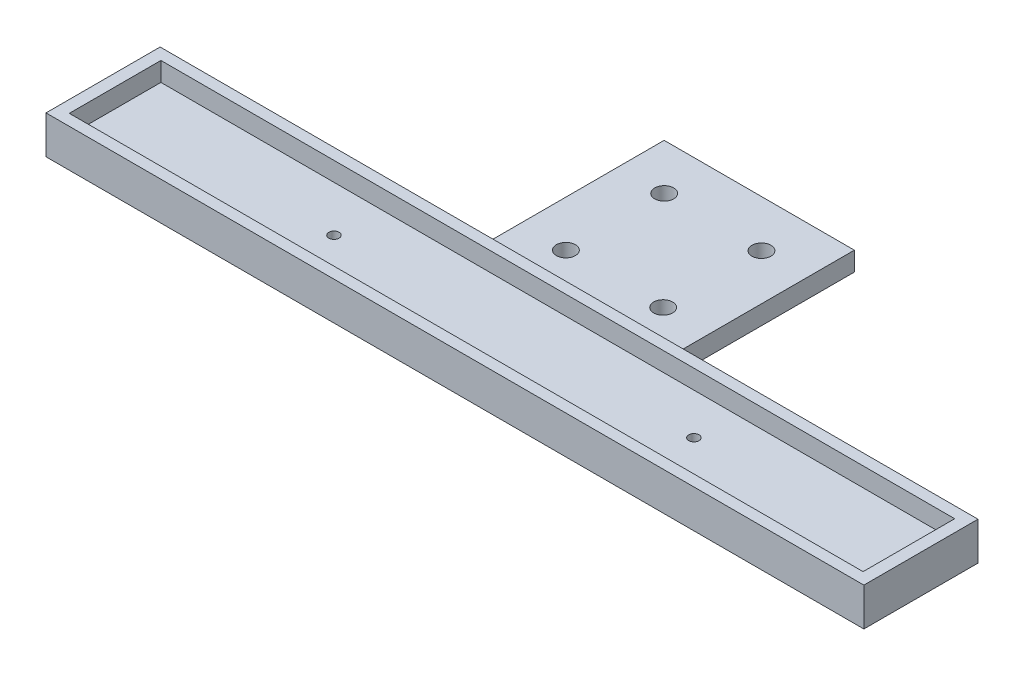
ISO-10303-21;
HEADER;
FILE_DESCRIPTION(('STEP AP214'),'2;1');
FILE_NAME('part.step','',(''),(''),'','','');
FILE_SCHEMA(('AUTOMOTIVE_DESIGN { 1 0 10303 214 1 1 1 1 }'));
ENDSEC;
DATA;
#1=APPLICATION_CONTEXT('core data for automotive mechanical design processes');
#2=APPLICATION_PROTOCOL_DEFINITION('international standard','automotive_design',2000,#1);
#3=PRODUCT_CONTEXT('',#1,'mechanical');
#4=PRODUCT('Part','Part','',(#3));
#5=PRODUCT_RELATED_PRODUCT_CATEGORY('part','',(#4));
#6=PRODUCT_DEFINITION_FORMATION('','',#4);
#7=PRODUCT_DEFINITION_CONTEXT('part definition',#1,'design');
#8=PRODUCT_DEFINITION('design','',#6,#7);
#9=PRODUCT_DEFINITION_SHAPE('','',#8);
#10=(LENGTH_UNIT() NAMED_UNIT(*) SI_UNIT(.MILLI.,.METRE.));
#11=(NAMED_UNIT(*) PLANE_ANGLE_UNIT() SI_UNIT($,.RADIAN.));
#12=(NAMED_UNIT(*) SI_UNIT($,.STERADIAN.) SOLID_ANGLE_UNIT());
#13=UNCERTAINTY_MEASURE_WITH_UNIT(LENGTH_MEASURE(1.E-05),#10,'distance_accuracy_value','');
#14=(GEOMETRIC_REPRESENTATION_CONTEXT(3) GLOBAL_UNCERTAINTY_ASSIGNED_CONTEXT((#13)) GLOBAL_UNIT_ASSIGNED_CONTEXT((#10,
#11,#12)) REPRESENTATION_CONTEXT('',''));
#15=CARTESIAN_POINT('',(0.,0.,0.));
#16=DIRECTION('',(0.,0.,1.));
#17=DIRECTION('',(1.,0.,0.));
#18=AXIS2_PLACEMENT_3D('',#15,#16,#17);
#19=CARTESIAN_POINT('',(64.4999999999998,3.,-9.00000000000003));
#20=DIRECTION('',(0.,0.,1.));
#21=DIRECTION('',(1.,0.,0.));
#22=AXIS2_PLACEMENT_3D('',#19,#20,#21);
#23=PLANE('',#22);
#24=DIRECTION('',(0.,-1.,0.));
#25=VECTOR('',#24,1.);
#26=CARTESIAN_POINT('',(15.,0.,-9.00000000000001));
#27=LINE('',#26,#25);
#28=CARTESIAN_POINT('',(15.,0.,-9.00000000000001));
#29=VERTEX_POINT('',#28);
#30=CARTESIAN_POINT('',(15.,-3.,-9.00000000000001));
#31=VERTEX_POINT('',#30);
#32=EDGE_CURVE('E157',#29,#31,#27,.T.);
#33=ORIENTED_EDGE('',*,*,#32,.F.);
#34=DIRECTION('',(-1.,0.,0.));
#35=VECTOR('',#34,1.);
#36=CARTESIAN_POINT('',(-15.,0.,-9.00000000000001));
#37=LINE('',#36,#35);
#38=CARTESIAN_POINT('',(-15.,0.,-9.00000000000001));
#39=VERTEX_POINT('',#38);
#40=EDGE_CURVE('E129',#29,#39,#37,.T.);
#41=ORIENTED_EDGE('',*,*,#40,.T.);
#42=DIRECTION('',(0.,-1.,0.));
#43=VECTOR('',#42,1.);
#44=CARTESIAN_POINT('',(-15.,0.,-9.00000000000001));
#45=LINE('',#44,#43);
#46=CARTESIAN_POINT('',(-15.,-3.,-9.00000000000001));
#47=VERTEX_POINT('',#46);
#48=EDGE_CURVE('E141',#39,#47,#45,.T.);
#49=ORIENTED_EDGE('',*,*,#48,.T.);
#50=DIRECTION('',(1.,0.,0.));
#51=VECTOR('',#50,1.);
#52=CARTESIAN_POINT('',(64.4999999999998,-3.,-9.00000000000001));
#53=LINE('',#52,#51);
#54=CARTESIAN_POINT('',(-64.5000000000002,-3.,-9.00000000000001));
#55=VERTEX_POINT('',#54);
#56=EDGE_CURVE('E181',#55,#47,#53,.T.);
#57=ORIENTED_EDGE('',*,*,#56,.F.);
#58=DIRECTION('',(0.,-1.,0.));
#59=VECTOR('',#58,1.);
#60=CARTESIAN_POINT('',(-64.5000000000002,3.,-9.00000000000001));
#61=LINE('',#60,#59);
#62=CARTESIAN_POINT('',(-64.5000000000002,3.,-9.00000000000001));
#63=VERTEX_POINT('',#62);
#64=EDGE_CURVE('E221',#63,#55,#61,.T.);
#65=ORIENTED_EDGE('',*,*,#64,.F.);
#66=DIRECTION('',(-1.,0.,0.));
#67=VECTOR('',#66,1.);
#68=CARTESIAN_POINT('',(64.4999999999998,3.,-9.00000000000003));
#69=LINE('',#68,#67);
#70=CARTESIAN_POINT('',(64.4999999999998,3.,-9.00000000000003));
#71=VERTEX_POINT('',#70);
#72=EDGE_CURVE('E219',#71,#63,#69,.T.);
#73=ORIENTED_EDGE('',*,*,#72,.F.);
#74=DIRECTION('',(0.,-1.,0.));
#75=VECTOR('',#74,1.);
#76=CARTESIAN_POINT('',(64.4999999999998,3.,-9.00000000000003));
#77=LINE('',#76,#75);
#78=CARTESIAN_POINT('',(64.4999999999998,-3.,-9.00000000000001));
#79=VERTEX_POINT('',#78);
#80=EDGE_CURVE('E223',#71,#79,#77,.T.);
#81=ORIENTED_EDGE('',*,*,#80,.T.);
#82=EDGE_CURVE('E180',#31,#79,#53,.T.);
#83=ORIENTED_EDGE('',*,*,#82,.F.);
#84=EDGE_LOOP('',(#33,#41,#49,#57,#65,#73,#81,#83));
#85=FACE_BOUND('',#84,.T.);
#86=ADVANCED_FACE('F33',(#85),#23,.F.);
#87=CARTESIAN_POINT('',(0.,3.,0.));
#88=DIRECTION('',(0.,1.,0.));
#89=DIRECTION('',(0.,0.,1.));
#90=AXIS2_PLACEMENT_3D('',#87,#88,#89);
#91=PLANE('',#90);
#92=DIRECTION('',(0.,0.,1.));
#93=VECTOR('',#92,1.);
#94=CARTESIAN_POINT('',(-64.5000000000002,3.,8.99999999999999));
#95=LINE('',#94,#93);
#96=CARTESIAN_POINT('',(-64.5000000000002,3.,8.99999999999999));
#97=VERTEX_POINT('',#96);
#98=EDGE_CURVE('E212',#63,#97,#95,.T.);
#99=ORIENTED_EDGE('',*,*,#98,.T.);
#100=DIRECTION('',(1.,0.,0.));
#101=VECTOR('',#100,1.);
#102=CARTESIAN_POINT('',(64.4999999999998,3.,8.99999999999997));
#103=LINE('',#102,#101);
#104=CARTESIAN_POINT('',(64.4999999999998,3.,8.99999999999997));
#105=VERTEX_POINT('',#104);
#106=EDGE_CURVE('E215',#97,#105,#103,.T.);
#107=ORIENTED_EDGE('',*,*,#106,.T.);
#108=DIRECTION('',(0.,0.,-1.));
#109=VECTOR('',#108,1.);
#110=CARTESIAN_POINT('',(64.4999999999998,3.,8.99999999999997));
#111=LINE('',#110,#109);
#112=EDGE_CURVE('E217',#105,#71,#111,.T.);
#113=ORIENTED_EDGE('',*,*,#112,.T.);
#114=ORIENTED_EDGE('',*,*,#72,.T.);
#115=EDGE_LOOP('',(#99,#107,#113,#114));
#116=FACE_BOUND('',#115,.T.);
#117=DIRECTION('',(1.,0.,0.));
#118=VECTOR('',#117,1.);
#119=CARTESIAN_POINT('',(62.5999999999998,3.,7.22499999999995));
#120=LINE('',#119,#118);
#121=CARTESIAN_POINT('',(-62.6000000000002,3.,7.22499999999995));
#122=VERTEX_POINT('',#121);
#123=CARTESIAN_POINT('',(62.5999999999998,3.,7.22499999999995));
#124=VERTEX_POINT('',#123);
#125=EDGE_CURVE('E187',#122,#124,#120,.T.);
#126=ORIENTED_EDGE('',*,*,#125,.F.);
#127=DIRECTION('',(0.,0.,1.));
#128=VECTOR('',#127,1.);
#129=CARTESIAN_POINT('',(-62.6000000000002,3.,7.22499999999995));
#130=LINE('',#129,#128);
#131=CARTESIAN_POINT('',(-62.6000000000002,3.,-7.22500000000001));
#132=VERTEX_POINT('',#131);
#133=EDGE_CURVE('E185',#132,#122,#130,.T.);
#134=ORIENTED_EDGE('',*,*,#133,.F.);
#135=DIRECTION('',(-1.,0.,0.));
#136=VECTOR('',#135,1.);
#137=CARTESIAN_POINT('',(62.5999999999998,3.,-7.22500000000001));
#138=LINE('',#137,#136);
#139=CARTESIAN_POINT('',(62.5999999999998,3.,-7.22500000000001));
#140=VERTEX_POINT('',#139);
#141=EDGE_CURVE('E192',#140,#132,#138,.T.);
#142=ORIENTED_EDGE('',*,*,#141,.F.);
#143=DIRECTION('',(0.,0.,-1.));
#144=VECTOR('',#143,1.);
#145=CARTESIAN_POINT('',(62.5999999999998,3.,7.22499999999995));
#146=LINE('',#145,#144);
#147=EDGE_CURVE('E190',#124,#140,#146,.T.);
#148=ORIENTED_EDGE('',*,*,#147,.F.);
#149=EDGE_LOOP('',(#126,#134,#142,#148));
#150=FACE_BOUND('',#149,.T.);
#151=ADVANCED_FACE('F248',(#116,#150),#91,.T.);
#152=CARTESIAN_POINT('',(-64.5000000000002,3.,8.99999999999999));
#153=DIRECTION('',(1.,0.,0.));
#154=DIRECTION('',(0.,0.,-1.));
#155=AXIS2_PLACEMENT_3D('',#152,#153,#154);
#156=PLANE('',#155);
#157=ORIENTED_EDGE('',*,*,#64,.T.);
#158=DIRECTION('',(0.,0.,-1.));
#159=VECTOR('',#158,1.);
#160=CARTESIAN_POINT('',(-64.5000000000002,-3.,8.99999999999997));
#161=LINE('',#160,#159);
#162=CARTESIAN_POINT('',(-64.5000000000002,-3.,8.99999999999997));
#163=VERTEX_POINT('',#162);
#164=EDGE_CURVE('E177',#163,#55,#161,.T.);
#165=ORIENTED_EDGE('',*,*,#164,.F.);
#166=DIRECTION('',(0.,-1.,0.));
#167=VECTOR('',#166,1.);
#168=CARTESIAN_POINT('',(-64.5000000000002,3.,8.99999999999999));
#169=LINE('',#168,#167);
#170=EDGE_CURVE('E11',#97,#163,#169,.T.);
#171=ORIENTED_EDGE('',*,*,#170,.F.);
#172=ORIENTED_EDGE('',*,*,#98,.F.);
#173=EDGE_LOOP('',(#157,#165,#171,#172));
#174=FACE_BOUND('',#173,.T.);
#175=ADVANCED_FACE('F35',(#174),#156,.F.);
#176=CARTESIAN_POINT('',(64.4999999999998,3.,8.99999999999997));
#177=DIRECTION('',(0.,0.,-1.));
#178=DIRECTION('',(-1.,0.,0.));
#179=AXIS2_PLACEMENT_3D('',#176,#177,#178);
#180=PLANE('',#179);
#181=ORIENTED_EDGE('',*,*,#170,.T.);
#182=DIRECTION('',(-1.,0.,0.));
#183=VECTOR('',#182,1.);
#184=CARTESIAN_POINT('',(64.4999999999998,-3.,8.99999999999997));
#185=LINE('',#184,#183);
#186=CARTESIAN_POINT('',(64.4999999999998,-3.,8.99999999999997));
#187=VERTEX_POINT('',#186);
#188=EDGE_CURVE('E174',#187,#163,#185,.T.);
#189=ORIENTED_EDGE('',*,*,#188,.F.);
#190=DIRECTION('',(0.,-1.,0.));
#191=VECTOR('',#190,1.);
#192=CARTESIAN_POINT('',(64.4999999999998,3.,8.99999999999997));
#193=LINE('',#192,#191);
#194=EDGE_CURVE('E41',#105,#187,#193,.T.);
#195=ORIENTED_EDGE('',*,*,#194,.F.);
#196=ORIENTED_EDGE('',*,*,#106,.F.);
#197=EDGE_LOOP('',(#181,#189,#195,#196));
#198=FACE_BOUND('',#197,.T.);
#199=ADVANCED_FACE('F233',(#198),#180,.F.);
#200=CARTESIAN_POINT('',(64.4999999999998,3.,8.99999999999997));
#201=DIRECTION('',(-1.,0.,0.));
#202=DIRECTION('',(0.,0.,1.));
#203=AXIS2_PLACEMENT_3D('',#200,#201,#202);
#204=PLANE('',#203);
#205=ORIENTED_EDGE('',*,*,#194,.T.);
#206=DIRECTION('',(0.,0.,1.));
#207=VECTOR('',#206,1.);
#208=CARTESIAN_POINT('',(64.4999999999998,-3.,8.99999999999997));
#209=LINE('',#208,#207);
#210=EDGE_CURVE('E163',#79,#187,#209,.T.);
#211=ORIENTED_EDGE('',*,*,#210,.F.);
#212=ORIENTED_EDGE('',*,*,#80,.F.);
#213=ORIENTED_EDGE('',*,*,#112,.F.);
#214=EDGE_LOOP('',(#205,#211,#212,#213));
#215=FACE_BOUND('',#214,.T.);
#216=ADVANCED_FACE('F230',(#215),#204,.F.);
#217=CARTESIAN_POINT('',(-62.6000000000002,3.,7.22499999999995));
#218=DIRECTION('',(1.,0.,0.));
#219=DIRECTION('',(0.,0.,-1.));
#220=AXIS2_PLACEMENT_3D('',#217,#218,#219);
#221=PLANE('',#220);
#222=DIRECTION('',(0.,0.,1.));
#223=VECTOR('',#222,1.);
#224=CARTESIAN_POINT('',(-62.6000000000002,0.,7.22499999999995));
#225=LINE('',#224,#223);
#226=CARTESIAN_POINT('',(-62.6000000000002,0.,-7.22500000000001));
#227=VERTEX_POINT('',#226);
#228=CARTESIAN_POINT('',(-62.6000000000002,0.,7.22499999999995));
#229=VERTEX_POINT('',#228);
#230=EDGE_CURVE('E184',#227,#229,#225,.T.);
#231=ORIENTED_EDGE('',*,*,#230,.F.);
#232=DIRECTION('',(0.,-1.,0.));
#233=VECTOR('',#232,1.);
#234=CARTESIAN_POINT('',(-62.6000000000002,3.,-7.22500000000001));
#235=LINE('',#234,#233);
#236=EDGE_CURVE('E194',#132,#227,#235,.T.);
#237=ORIENTED_EDGE('',*,*,#236,.F.);
#238=ORIENTED_EDGE('',*,*,#133,.T.);
#239=DIRECTION('',(0.,-1.,0.));
#240=VECTOR('',#239,1.);
#241=CARTESIAN_POINT('',(-62.6000000000002,3.,7.22499999999995));
#242=LINE('',#241,#240);
#243=EDGE_CURVE('E209',#122,#229,#242,.T.);
#244=ORIENTED_EDGE('',*,*,#243,.T.);
#245=EDGE_LOOP('',(#231,#237,#238,#244));
#246=FACE_BOUND('',#245,.T.);
#247=ADVANCED_FACE('F272',(#246),#221,.T.);
#248=CARTESIAN_POINT('',(62.5999999999998,3.,7.22499999999995));
#249=DIRECTION('',(0.,0.,-1.));
#250=DIRECTION('',(-1.,0.,0.));
#251=AXIS2_PLACEMENT_3D('',#248,#249,#250);
#252=PLANE('',#251);
#253=DIRECTION('',(1.,0.,0.));
#254=VECTOR('',#253,1.);
#255=CARTESIAN_POINT('',(62.5999999999998,0.,7.22499999999995));
#256=LINE('',#255,#254);
#257=CARTESIAN_POINT('',(62.5999999999998,0.,7.22499999999995));
#258=VERTEX_POINT('',#257);
#259=EDGE_CURVE('E197',#229,#258,#256,.T.);
#260=ORIENTED_EDGE('',*,*,#259,.F.);
#261=ORIENTED_EDGE('',*,*,#243,.F.);
#262=ORIENTED_EDGE('',*,*,#125,.T.);
#263=DIRECTION('',(0.,-1.,0.));
#264=VECTOR('',#263,1.);
#265=CARTESIAN_POINT('',(62.5999999999998,3.,7.22499999999995));
#266=LINE('',#265,#264);
#267=EDGE_CURVE('E207',#124,#258,#266,.T.);
#268=ORIENTED_EDGE('',*,*,#267,.T.);
#269=EDGE_LOOP('',(#260,#261,#262,#268));
#270=FACE_BOUND('',#269,.T.);
#271=ADVANCED_FACE('F313',(#270),#252,.T.);
#272=CARTESIAN_POINT('',(62.5999999999998,3.,7.22499999999995));
#273=DIRECTION('',(-1.,0.,0.));
#274=DIRECTION('',(0.,0.,1.));
#275=AXIS2_PLACEMENT_3D('',#272,#273,#274);
#276=PLANE('',#275);
#277=DIRECTION('',(0.,0.,-1.));
#278=VECTOR('',#277,1.);
#279=CARTESIAN_POINT('',(62.5999999999998,0.,7.22499999999995));
#280=LINE('',#279,#278);
#281=CARTESIAN_POINT('',(62.5999999999998,0.,-7.22500000000001));
#282=VERTEX_POINT('',#281);
#283=EDGE_CURVE('E200',#258,#282,#280,.T.);
#284=ORIENTED_EDGE('',*,*,#283,.F.);
#285=ORIENTED_EDGE('',*,*,#267,.F.);
#286=ORIENTED_EDGE('',*,*,#147,.T.);
#287=DIRECTION('',(0.,-1.,0.));
#288=VECTOR('',#287,1.);
#289=CARTESIAN_POINT('',(62.5999999999998,3.,-7.22500000000001));
#290=LINE('',#289,#288);
#291=EDGE_CURVE('E56',#140,#282,#290,.T.);
#292=ORIENTED_EDGE('',*,*,#291,.T.);
#293=EDGE_LOOP('',(#284,#285,#286,#292));
#294=FACE_BOUND('',#293,.T.);
#295=ADVANCED_FACE('F321',(#294),#276,.T.);
#296=CARTESIAN_POINT('',(62.5999999999998,3.,-7.22500000000001));
#297=DIRECTION('',(0.,0.,1.));
#298=DIRECTION('',(1.,0.,0.));
#299=AXIS2_PLACEMENT_3D('',#296,#297,#298);
#300=PLANE('',#299);
#301=DIRECTION('',(-1.,0.,0.));
#302=VECTOR('',#301,1.);
#303=CARTESIAN_POINT('',(62.5999999999998,0.,-7.22500000000001));
#304=LINE('',#303,#302);
#305=EDGE_CURVE('E188',#282,#227,#304,.T.);
#306=ORIENTED_EDGE('',*,*,#305,.F.);
#307=ORIENTED_EDGE('',*,*,#291,.F.);
#308=ORIENTED_EDGE('',*,*,#141,.T.);
#309=ORIENTED_EDGE('',*,*,#236,.T.);
#310=EDGE_LOOP('',(#306,#307,#308,#309));
#311=FACE_BOUND('',#310,.T.);
#312=ADVANCED_FACE('F329',(#311),#300,.T.);
#313=CARTESIAN_POINT('',(0.,0.,0.));
#314=DIRECTION('',(0.,1.,0.));
#315=DIRECTION('',(0.,0.,1.));
#316=AXIS2_PLACEMENT_3D('',#313,#314,#315);
#317=PLANE('',#316);
#318=CARTESIAN_POINT('',(27.9699999999998,0.,-0.72500000000001));
#319=DIRECTION('',(0.,1.,0.));
#320=DIRECTION('',(0.,0.,1.));
#321=AXIS2_PLACEMENT_3D('',#318,#319,#320);
#322=CIRCLE('',#321,0.809999999999999);
#323=CARTESIAN_POINT('',(27.9699999999998,0.,0.0849999999999887));
#324=VERTEX_POINT('',#323);
#325=EDGE_CURVE('E164',#324,#324,#322,.T.);
#326=ORIENTED_EDGE('',*,*,#325,.F.);
#327=EDGE_LOOP('',(#326));
#328=FACE_BOUND('',#327,.T.);
#329=CARTESIAN_POINT('',(-28.0800000000002,0.,0.));
#330=DIRECTION('',(0.,1.,0.));
#331=DIRECTION('',(0.,0.,1.));
#332=AXIS2_PLACEMENT_3D('',#329,#330,#331);
#333=CIRCLE('',#332,0.809999999999999);
#334=CARTESIAN_POINT('',(-28.0800000000002,0.,0.809999999999999));
#335=VERTEX_POINT('',#334);
#336=EDGE_CURVE('E156',#335,#335,#333,.T.);
#337=ORIENTED_EDGE('',*,*,#336,.F.);
#338=EDGE_LOOP('',(#337));
#339=FACE_BOUND('',#338,.T.);
#340=ORIENTED_EDGE('',*,*,#305,.T.);
#341=ORIENTED_EDGE('',*,*,#230,.T.);
#342=ORIENTED_EDGE('',*,*,#259,.T.);
#343=ORIENTED_EDGE('',*,*,#283,.T.);
#344=EDGE_LOOP('',(#340,#341,#342,#343));
#345=FACE_BOUND('',#344,.T.);
#346=ADVANCED_FACE('F337',(#328,#339,#345),#317,.T.);
#347=CARTESIAN_POINT('',(0.,-3.,0.));
#348=DIRECTION('',(0.,1.,0.));
#349=DIRECTION('',(0.,0.,1.));
#350=AXIS2_PLACEMENT_3D('',#347,#348,#349);
#351=PLANE('',#350);
#352=CARTESIAN_POINT('',(27.9699999999998,-3.,-0.72500000000001));
#353=DIRECTION('',(0.,1.,0.));
#354=DIRECTION('',(0.,0.,1.));
#355=AXIS2_PLACEMENT_3D('',#352,#353,#354);
#356=CIRCLE('',#355,0.809999999999999);
#357=CARTESIAN_POINT('',(27.9699999999998,-3.,0.0849999999999887));
#358=VERTEX_POINT('',#357);
#359=EDGE_CURVE('E160',#358,#358,#356,.T.);
#360=ORIENTED_EDGE('',*,*,#359,.T.);
#361=EDGE_LOOP('',(#360));
#362=FACE_BOUND('',#361,.T.);
#363=CARTESIAN_POINT('',(-28.0800000000002,-3.,0.));
#364=DIRECTION('',(0.,1.,0.));
#365=DIRECTION('',(0.,0.,1.));
#366=AXIS2_PLACEMENT_3D('',#363,#364,#365);
#367=CIRCLE('',#366,0.809999999999999);
#368=CARTESIAN_POINT('',(-28.0800000000002,-3.,0.809999999999999));
#369=VERTEX_POINT('',#368);
#370=EDGE_CURVE('E167',#369,#369,#367,.T.);
#371=ORIENTED_EDGE('',*,*,#370,.T.);
#372=EDGE_LOOP('',(#371));
#373=FACE_BOUND('',#372,.T.);
#374=ORIENTED_EDGE('',*,*,#210,.T.);
#375=ORIENTED_EDGE('',*,*,#188,.T.);
#376=ORIENTED_EDGE('',*,*,#164,.T.);
#377=ORIENTED_EDGE('',*,*,#56,.T.);
#378=DIRECTION('',(0.,0.,-1.));
#379=VECTOR('',#378,1.);
#380=CARTESIAN_POINT('',(-15.,-3.,-9.00000000000001));
#381=LINE('',#380,#379);
#382=CARTESIAN_POINT('',(-15.,-3.,-39.));
#383=VERTEX_POINT('',#382);
#384=EDGE_CURVE('E48',#47,#383,#381,.T.);
#385=ORIENTED_EDGE('',*,*,#384,.T.);
#386=DIRECTION('',(1.,0.,0.));
#387=VECTOR('',#386,1.);
#388=CARTESIAN_POINT('',(-15.,-3.,-39.));
#389=LINE('',#388,#387);
#390=CARTESIAN_POINT('',(15.,-3.,-39.));
#391=VERTEX_POINT('',#390);
#392=EDGE_CURVE('E126',#383,#391,#389,.T.);
#393=ORIENTED_EDGE('',*,*,#392,.T.);
#394=DIRECTION('',(0.,0.,1.));
#395=VECTOR('',#394,1.);
#396=CARTESIAN_POINT('',(15.,-3.,-9.00000000000001));
#397=LINE('',#396,#395);
#398=EDGE_CURVE('E142',#391,#31,#397,.T.);
#399=ORIENTED_EDGE('',*,*,#398,.T.);
#400=ORIENTED_EDGE('',*,*,#82,.T.);
#401=EDGE_LOOP('',(#374,#375,#376,#377,#385,#393,#399,#400));
#402=FACE_BOUND('',#401,.T.);
#403=CARTESIAN_POINT('',(-7.74920183780255,-3.,-16.2500000205504));
#404=DIRECTION('',(0.,-1.,0.));
#405=DIRECTION('',(0.,0.,-1.));
#406=AXIS2_PLACEMENT_3D('',#403,#404,#405);
#407=CIRCLE('',#406,1.5);
#408=CARTESIAN_POINT('',(-7.74920183780255,-3.,-17.7500000205504));
#409=VERTEX_POINT('',#408);
#410=EDGE_CURVE('E453',#409,#409,#407,.T.);
#411=ORIENTED_EDGE('',*,*,#410,.F.);
#412=EDGE_LOOP('',(#411));
#413=FACE_BOUND('',#412,.T.);
#414=CARTESIAN_POINT('',(7.75,-3.,-16.0927028779885));
#415=DIRECTION('',(0.,-1.,0.));
#416=DIRECTION('',(0.,0.,-1.));
#417=AXIS2_PLACEMENT_3D('',#414,#415,#416);
#418=CIRCLE('',#417,1.5);
#419=CARTESIAN_POINT('',(7.75,-3.,-17.5927028779885));
#420=VERTEX_POINT('',#419);
#421=EDGE_CURVE('E455',#420,#420,#418,.T.);
#422=ORIENTED_EDGE('',*,*,#421,.F.);
#423=EDGE_LOOP('',(#422));
#424=FACE_BOUND('',#423,.T.);
#425=CARTESIAN_POINT('',(-7.74999999999999,-3.,-31.75));
#426=DIRECTION('',(0.,-1.,0.));
#427=DIRECTION('',(0.,0.,-1.));
#428=AXIS2_PLACEMENT_3D('',#425,#426,#427);
#429=CIRCLE('',#428,1.5);
#430=CARTESIAN_POINT('',(-7.74999999999999,-3.,-33.25));
#431=VERTEX_POINT('',#430);
#432=EDGE_CURVE('E461',#431,#431,#429,.T.);
#433=ORIENTED_EDGE('',*,*,#432,.F.);
#434=EDGE_LOOP('',(#433));
#435=FACE_BOUND('',#434,.T.);
#436=CARTESIAN_POINT('',(7.74920183780256,-3.,-31.5927028574381));
#437=DIRECTION('',(0.,-1.,0.));
#438=DIRECTION('',(0.,0.,-1.));
#439=AXIS2_PLACEMENT_3D('',#436,#437,#438);
#440=CIRCLE('',#439,1.5);
#441=CARTESIAN_POINT('',(7.74920183780256,-3.,-33.0927028574381));
#442=VERTEX_POINT('',#441);
#443=EDGE_CURVE('E147',#442,#442,#440,.T.);
#444=ORIENTED_EDGE('',*,*,#443,.F.);
#445=EDGE_LOOP('',(#444));
#446=FACE_BOUND('',#445,.T.);
#447=ADVANCED_FACE('F237',(#362,#373,#402,#413,#424,#435,#446),#351,.F.);
#448=CARTESIAN_POINT('',(-28.0800000000002,-3.,0.));
#449=DIRECTION('',(0.,1.,0.));
#450=DIRECTION('',(0.,0.,1.));
#451=AXIS2_PLACEMENT_3D('',#448,#449,#450);
#452=CYLINDRICAL_SURFACE('',#451,0.809999999999999);
#453=ORIENTED_EDGE('',*,*,#370,.F.);
#454=EDGE_LOOP('',(#453));
#455=FACE_BOUND('',#454,.T.);
#456=ORIENTED_EDGE('',*,*,#336,.T.);
#457=EDGE_LOOP('',(#456));
#458=FACE_BOUND('',#457,.T.);
#459=ADVANCED_FACE('F352',(#455,#458),#452,.F.);
#460=CARTESIAN_POINT('',(27.9699999999998,-3.,-0.72500000000001));
#461=DIRECTION('',(0.,1.,0.));
#462=DIRECTION('',(0.,0.,1.));
#463=AXIS2_PLACEMENT_3D('',#460,#461,#462);
#464=CYLINDRICAL_SURFACE('',#463,0.809999999999999);
#465=ORIENTED_EDGE('',*,*,#359,.F.);
#466=EDGE_LOOP('',(#465));
#467=FACE_BOUND('',#466,.T.);
#468=ORIENTED_EDGE('',*,*,#325,.T.);
#469=EDGE_LOOP('',(#468));
#470=FACE_BOUND('',#469,.T.);
#471=ADVANCED_FACE('F260',(#467,#470),#464,.F.);
#472=CARTESIAN_POINT('',(-15.,0.,-9.00000000000001));
#473=DIRECTION('',(-1.,0.,0.));
#474=DIRECTION('',(0.,0.,1.));
#475=AXIS2_PLACEMENT_3D('',#472,#473,#474);
#476=PLANE('',#475);
#477=ORIENTED_EDGE('',*,*,#384,.F.);
#478=ORIENTED_EDGE('',*,*,#48,.F.);
#479=DIRECTION('',(0.,0.,-1.));
#480=VECTOR('',#479,1.);
#481=CARTESIAN_POINT('',(-15.,0.,-9.00000000000001));
#482=LINE('',#481,#480);
#483=CARTESIAN_POINT('',(-15.,0.,-39.));
#484=VERTEX_POINT('',#483);
#485=EDGE_CURVE('E136',#39,#484,#482,.T.);
#486=ORIENTED_EDGE('',*,*,#485,.T.);
#487=DIRECTION('',(0.,-1.,0.));
#488=VECTOR('',#487,1.);
#489=CARTESIAN_POINT('',(-15.,0.,-39.));
#490=LINE('',#489,#488);
#491=EDGE_CURVE('E121',#484,#383,#490,.T.);
#492=ORIENTED_EDGE('',*,*,#491,.T.);
#493=EDGE_LOOP('',(#477,#478,#486,#492));
#494=FACE_BOUND('',#493,.T.);
#495=ADVANCED_FACE('F140',(#494),#476,.T.);
#496=CARTESIAN_POINT('',(15.,0.,-9.00000000000001));
#497=DIRECTION('',(1.,0.,0.));
#498=DIRECTION('',(0.,0.,-1.));
#499=AXIS2_PLACEMENT_3D('',#496,#497,#498);
#500=PLANE('',#499);
#501=ORIENTED_EDGE('',*,*,#398,.F.);
#502=DIRECTION('',(0.,-1.,0.));
#503=VECTOR('',#502,1.);
#504=CARTESIAN_POINT('',(15.,0.,-39.));
#505=LINE('',#504,#503);
#506=CARTESIAN_POINT('',(15.,0.,-39.));
#507=VERTEX_POINT('',#506);
#508=EDGE_CURVE('E128',#507,#391,#505,.T.);
#509=ORIENTED_EDGE('',*,*,#508,.F.);
#510=DIRECTION('',(0.,0.,1.));
#511=VECTOR('',#510,1.);
#512=CARTESIAN_POINT('',(15.,0.,-9.00000000000001));
#513=LINE('',#512,#511);
#514=EDGE_CURVE('E138',#507,#29,#513,.T.);
#515=ORIENTED_EDGE('',*,*,#514,.T.);
#516=ORIENTED_EDGE('',*,*,#32,.T.);
#517=EDGE_LOOP('',(#501,#509,#515,#516));
#518=FACE_BOUND('',#517,.T.);
#519=ADVANCED_FACE('F252',(#518),#500,.T.);
#520=CARTESIAN_POINT('',(-15.,0.,-39.));
#521=DIRECTION('',(0.,0.,-1.));
#522=DIRECTION('',(-1.,0.,0.));
#523=AXIS2_PLACEMENT_3D('',#520,#521,#522);
#524=PLANE('',#523);
#525=ORIENTED_EDGE('',*,*,#392,.F.);
#526=ORIENTED_EDGE('',*,*,#491,.F.);
#527=DIRECTION('',(1.,0.,0.));
#528=VECTOR('',#527,1.);
#529=CARTESIAN_POINT('',(-15.,0.,-39.));
#530=LINE('',#529,#528);
#531=EDGE_CURVE('E124',#484,#507,#530,.T.);
#532=ORIENTED_EDGE('',*,*,#531,.T.);
#533=ORIENTED_EDGE('',*,*,#508,.T.);
#534=EDGE_LOOP('',(#525,#526,#532,#533));
#535=FACE_BOUND('',#534,.T.);
#536=ADVANCED_FACE('F123',(#535),#524,.T.);
#537=CARTESIAN_POINT('',(0.,0.,0.));
#538=DIRECTION('',(0.,-1.,0.));
#539=DIRECTION('',(0.,0.,-1.));
#540=AXIS2_PLACEMENT_3D('',#537,#538,#539);
#541=PLANE('',#540);
#542=CARTESIAN_POINT('',(-7.74920183780255,0.,-16.2500000205504));
#543=DIRECTION('',(0.,-1.,0.));
#544=DIRECTION('',(0.,0.,-1.));
#545=AXIS2_PLACEMENT_3D('',#542,#543,#544);
#546=CIRCLE('',#545,1.5);
#547=CARTESIAN_POINT('',(-7.74920183780255,0.,-17.7500000205504));
#548=VERTEX_POINT('',#547);
#549=EDGE_CURVE('E450',#548,#548,#546,.T.);
#550=ORIENTED_EDGE('',*,*,#549,.T.);
#551=EDGE_LOOP('',(#550));
#552=FACE_BOUND('',#551,.T.);
#553=CARTESIAN_POINT('',(7.75,0.,-16.0927028779885));
#554=DIRECTION('',(0.,-1.,0.));
#555=DIRECTION('',(0.,0.,-1.));
#556=AXIS2_PLACEMENT_3D('',#553,#554,#555);
#557=CIRCLE('',#556,1.5);
#558=CARTESIAN_POINT('',(7.75,0.,-17.5927028779885));
#559=VERTEX_POINT('',#558);
#560=EDGE_CURVE('E458',#559,#559,#557,.T.);
#561=ORIENTED_EDGE('',*,*,#560,.T.);
#562=EDGE_LOOP('',(#561));
#563=FACE_BOUND('',#562,.T.);
#564=CARTESIAN_POINT('',(-7.74999999999999,0.,-31.75));
#565=DIRECTION('',(0.,-1.,0.));
#566=DIRECTION('',(0.,0.,-1.));
#567=AXIS2_PLACEMENT_3D('',#564,#565,#566);
#568=CIRCLE('',#567,1.5);
#569=CARTESIAN_POINT('',(-7.74999999999999,0.,-33.25));
#570=VERTEX_POINT('',#569);
#571=EDGE_CURVE('E464',#570,#570,#568,.T.);
#572=ORIENTED_EDGE('',*,*,#571,.T.);
#573=EDGE_LOOP('',(#572));
#574=FACE_BOUND('',#573,.T.);
#575=CARTESIAN_POINT('',(7.74920183780256,0.,-31.5927028574381));
#576=DIRECTION('',(0.,-1.,0.));
#577=DIRECTION('',(0.,0.,-1.));
#578=AXIS2_PLACEMENT_3D('',#575,#576,#577);
#579=CIRCLE('',#578,1.5);
#580=CARTESIAN_POINT('',(7.74920183780256,0.,-33.0927028574381));
#581=VERTEX_POINT('',#580);
#582=EDGE_CURVE('E153',#581,#581,#579,.T.);
#583=ORIENTED_EDGE('',*,*,#582,.T.);
#584=EDGE_LOOP('',(#583));
#585=FACE_BOUND('',#584,.T.);
#586=ORIENTED_EDGE('',*,*,#485,.F.);
#587=ORIENTED_EDGE('',*,*,#40,.F.);
#588=ORIENTED_EDGE('',*,*,#514,.F.);
#589=ORIENTED_EDGE('',*,*,#531,.F.);
#590=EDGE_LOOP('',(#586,#587,#588,#589));
#591=FACE_BOUND('',#590,.T.);
#592=ADVANCED_FACE('F134',(#552,#563,#574,#585,#591),#541,.F.);
#593=CARTESIAN_POINT('',(7.74920183780256,0.,-31.5927028574381));
#594=DIRECTION('',(0.,-1.,0.));
#595=DIRECTION('',(0.,0.,-1.));
#596=AXIS2_PLACEMENT_3D('',#593,#594,#595);
#597=CYLINDRICAL_SURFACE('',#596,1.5);
#598=ORIENTED_EDGE('',*,*,#582,.F.);
#599=EDGE_LOOP('',(#598));
#600=FACE_BOUND('',#599,.T.);
#601=ORIENTED_EDGE('',*,*,#443,.T.);
#602=EDGE_LOOP('',(#601));
#603=FACE_BOUND('',#602,.T.);
#604=ADVANCED_FACE('F404',(#600,#603),#597,.F.);
#605=CARTESIAN_POINT('',(-7.74999999999999,0.,-31.75));
#606=DIRECTION('',(0.,-1.,0.));
#607=DIRECTION('',(0.,0.,-1.));
#608=AXIS2_PLACEMENT_3D('',#605,#606,#607);
#609=CYLINDRICAL_SURFACE('',#608,1.5);
#610=ORIENTED_EDGE('',*,*,#571,.F.);
#611=EDGE_LOOP('',(#610));
#612=FACE_BOUND('',#611,.T.);
#613=ORIENTED_EDGE('',*,*,#432,.T.);
#614=EDGE_LOOP('',(#613));
#615=FACE_BOUND('',#614,.T.);
#616=ADVANCED_FACE('F413',(#612,#615),#609,.F.);
#617=CARTESIAN_POINT('',(7.75,0.,-16.0927028779885));
#618=DIRECTION('',(0.,-1.,0.));
#619=DIRECTION('',(0.,0.,-1.));
#620=AXIS2_PLACEMENT_3D('',#617,#618,#619);
#621=CYLINDRICAL_SURFACE('',#620,1.5);
#622=ORIENTED_EDGE('',*,*,#560,.F.);
#623=EDGE_LOOP('',(#622));
#624=FACE_BOUND('',#623,.T.);
#625=ORIENTED_EDGE('',*,*,#421,.T.);
#626=EDGE_LOOP('',(#625));
#627=FACE_BOUND('',#626,.T.);
#628=ADVANCED_FACE('F423',(#624,#627),#621,.F.);
#629=CARTESIAN_POINT('',(-7.74920183780255,0.,-16.2500000205504));
#630=DIRECTION('',(0.,-1.,0.));
#631=DIRECTION('',(0.,0.,-1.));
#632=AXIS2_PLACEMENT_3D('',#629,#630,#631);
#633=CYLINDRICAL_SURFACE('',#632,1.5);
#634=ORIENTED_EDGE('',*,*,#549,.F.);
#635=EDGE_LOOP('',(#634));
#636=FACE_BOUND('',#635,.T.);
#637=ORIENTED_EDGE('',*,*,#410,.T.);
#638=EDGE_LOOP('',(#637));
#639=FACE_BOUND('',#638,.T.);
#640=ADVANCED_FACE('F433',(#636,#639),#633,.F.);
#641=CLOSED_SHELL('',(#86,#151,#175,#199,#216,#247,#271,#295,#312,#346,#447,#459,#471,#495,#519,
#536,#592,#604,#616,#628,#640));
#642=MANIFOLD_SOLID_BREP('B2',#641);
#643=ADVANCED_BREP_SHAPE_REPRESENTATION('',(#18,#642),#14);
#644=SHAPE_DEFINITION_REPRESENTATION(#9,#643);
ENDSEC;
END-ISO-10303-21;
